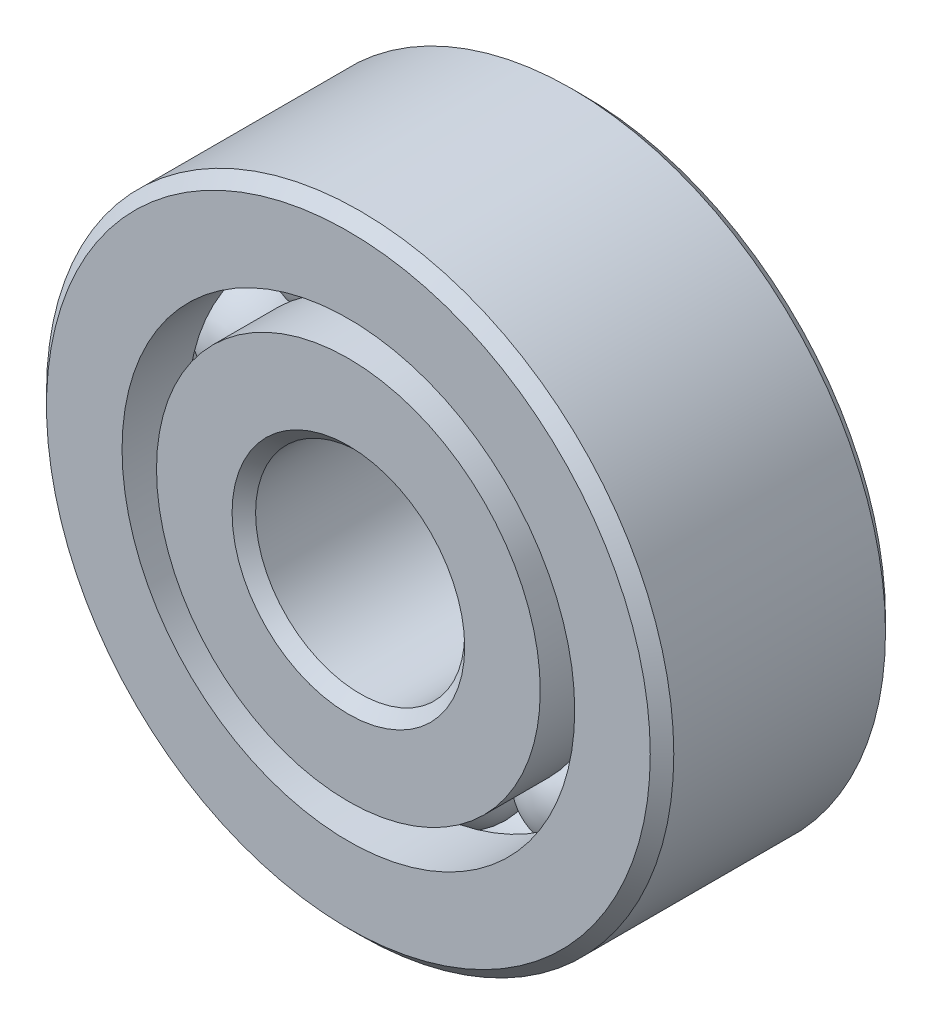
ISO-10303-21;
HEADER;
FILE_DESCRIPTION(('STEP AP214'),'2;1');
FILE_NAME('part.step','',(''),(''),'','','');
FILE_SCHEMA(('AUTOMOTIVE_DESIGN { 1 0 10303 214 1 1 1 1 }'));
ENDSEC;
DATA;
#1=APPLICATION_CONTEXT('core data for automotive mechanical design processes');
#2=APPLICATION_PROTOCOL_DEFINITION('international standard','automotive_design',2000,#1);
#3=PRODUCT_CONTEXT('',#1,'mechanical');
#4=PRODUCT('Part','Part','',(#3));
#5=PRODUCT_RELATED_PRODUCT_CATEGORY('part','',(#4));
#6=PRODUCT_DEFINITION_FORMATION('','',#4);
#7=PRODUCT_DEFINITION_CONTEXT('part definition',#1,'design');
#8=PRODUCT_DEFINITION('design','',#6,#7);
#9=PRODUCT_DEFINITION_SHAPE('','',#8);
#10=(LENGTH_UNIT() NAMED_UNIT(*) SI_UNIT(.MILLI.,.METRE.));
#11=(NAMED_UNIT(*) PLANE_ANGLE_UNIT() SI_UNIT($,.RADIAN.));
#12=(NAMED_UNIT(*) SI_UNIT($,.STERADIAN.) SOLID_ANGLE_UNIT());
#13=UNCERTAINTY_MEASURE_WITH_UNIT(LENGTH_MEASURE(1.E-05),#10,'distance_accuracy_value','');
#14=(GEOMETRIC_REPRESENTATION_CONTEXT(3) GLOBAL_UNCERTAINTY_ASSIGNED_CONTEXT((#13)) GLOBAL_UNIT_ASSIGNED_CONTEXT((#10,
#11,#12)) REPRESENTATION_CONTEXT('',''));
#15=CARTESIAN_POINT('',(0.,0.,0.));
#16=DIRECTION('',(0.,0.,1.));
#17=DIRECTION('',(1.,0.,0.));
#18=AXIS2_PLACEMENT_3D('',#15,#16,#17);
#19=CARTESIAN_POINT('',(-3.73243635205714,5.13725791428097,0.));
#20=DIRECTION('',(0.,0.,1.));
#21=DIRECTION('',(-0.587785252292462,0.809016994374955,0.));
#22=AXIS2_PLACEMENT_3D('',#19,#20,#21);
#23=SPHERICAL_SURFACE('',#22,1.67154216154795);
#24=CARTESIAN_POINT('',(-3.73243635205714,5.13725791428097,1.67154216154795));
#25=VERTEX_POINT('',#24);
#26=VERTEX_LOOP('',#25);
#27=FACE_BOUND('',#26,.T.);
#28=ADVANCED_FACE('F37',(#27),#23,.T.);
#29=CLOSED_SHELL('',(#28));
#30=MANIFOLD_SOLID_BREP('B2',#29);
#31=CARTESIAN_POINT('',(-6.0392088784742,1.96225791428099,0.));
#32=DIRECTION('',(0.,0.,1.));
#33=DIRECTION('',(-0.95105651629515,0.309016994374958,0.));
#34=AXIS2_PLACEMENT_3D('',#31,#32,#33);
#35=SPHERICAL_SURFACE('',#34,1.67154216154795);
#36=CARTESIAN_POINT('',(-6.0392088784742,1.96225791428099,1.67154216154795));
#37=VERTEX_POINT('',#36);
#38=VERTEX_LOOP('',#37);
#39=FACE_BOUND('',#38,.T.);
#40=ADVANCED_FACE('F57',(#39),#35,.T.);
#41=CLOSED_SHELL('',(#40));
#42=MANIFOLD_SOLID_BREP('B6',#41);
#43=CARTESIAN_POINT('',(-6.03920887847425,-1.96225791428086,0.));
#44=DIRECTION('',(0.,0.,1.));
#45=DIRECTION('',(-0.951056516295157,-0.309016994374938,0.));
#46=AXIS2_PLACEMENT_3D('',#43,#44,#45);
#47=SPHERICAL_SURFACE('',#46,1.67154216154795);
#48=CARTESIAN_POINT('',(-6.03920887847425,-1.96225791428086,1.67154216154795));
#49=VERTEX_POINT('',#48);
#50=VERTEX_LOOP('',#49);
#51=FACE_BOUND('',#50,.T.);
#52=ADVANCED_FACE('F77',(#51),#47,.T.);
#53=CLOSED_SHELL('',(#52));
#54=MANIFOLD_SOLID_BREP('B33',#53);
#55=CARTESIAN_POINT('',(-3.73243635205725,-5.13725791428089,0.));
#56=DIRECTION('',(0.,0.,1.));
#57=DIRECTION('',(-0.58778525229248,-0.809016994374942,0.));
#58=AXIS2_PLACEMENT_3D('',#55,#56,#57);
#59=SPHERICAL_SURFACE('',#58,1.67154216154795);
#60=CARTESIAN_POINT('',(-3.73243635205725,-5.13725791428089,1.67154216154795));
#61=VERTEX_POINT('',#60);
#62=VERTEX_LOOP('',#61);
#63=FACE_BOUND('',#62,.T.);
#64=ADVANCED_FACE('F97',(#63),#59,.T.);
#65=CLOSED_SHELL('',(#64));
#66=MANIFOLD_SOLID_BREP('B53',#65);
#67=CARTESIAN_POINT('',(0.,-6.35,0.));
#68=DIRECTION('',(0.,0.,1.));
#69=DIRECTION('',(0.,-1.,0.));
#70=AXIS2_PLACEMENT_3D('',#67,#68,#69);
#71=SPHERICAL_SURFACE('',#70,1.67154216154795);
#72=CARTESIAN_POINT('',(0.,-6.35,1.67154216154795));
#73=VERTEX_POINT('',#72);
#74=VERTEX_LOOP('',#73);
#75=FACE_BOUND('',#74,.T.);
#76=ADVANCED_FACE('F117',(#75),#71,.T.);
#77=CLOSED_SHELL('',(#76));
#78=MANIFOLD_SOLID_BREP('B73',#77);
#79=CARTESIAN_POINT('',(3.73243635205718,-5.13725791428094,0.));
#80=DIRECTION('',(0.,0.,1.));
#81=DIRECTION('',(0.587785252292469,-0.809016994374951,0.));
#82=AXIS2_PLACEMENT_3D('',#79,#80,#81);
#83=SPHERICAL_SURFACE('',#82,1.67154216154795);
#84=CARTESIAN_POINT('',(3.73243635205718,-5.13725791428094,1.67154216154795));
#85=VERTEX_POINT('',#84);
#86=VERTEX_LOOP('',#85);
#87=FACE_BOUND('',#86,.T.);
#88=ADVANCED_FACE('F137',(#87),#83,.T.);
#89=CLOSED_SHELL('',(#88));
#90=MANIFOLD_SOLID_BREP('B93',#89);
#91=CARTESIAN_POINT('',(6.03920887847422,-1.96225791428094,0.));
#92=DIRECTION('',(0.,0.,1.));
#93=DIRECTION('',(0.951056516295152,-0.309016994374952,0.));
#94=AXIS2_PLACEMENT_3D('',#91,#92,#93);
#95=SPHERICAL_SURFACE('',#94,1.67154216154795);
#96=CARTESIAN_POINT('',(6.03920887847422,-1.96225791428094,1.67154216154795));
#97=VERTEX_POINT('',#96);
#98=VERTEX_LOOP('',#97);
#99=FACE_BOUND('',#98,.T.);
#100=ADVANCED_FACE('F157',(#99),#95,.T.);
#101=CLOSED_SHELL('',(#100));
#102=MANIFOLD_SOLID_BREP('B113',#101);
#103=CARTESIAN_POINT('',(6.03920887847423,1.9622579142809,0.));
#104=DIRECTION('',(0.,0.,1.));
#105=DIRECTION('',(0.951056516295155,0.309016994374945,0.));
#106=AXIS2_PLACEMENT_3D('',#103,#104,#105);
#107=SPHERICAL_SURFACE('',#106,1.67154216154795);
#108=CARTESIAN_POINT('',(6.03920887847423,1.9622579142809,1.67154216154795));
#109=VERTEX_POINT('',#108);
#110=VERTEX_LOOP('',#109);
#111=FACE_BOUND('',#110,.T.);
#112=ADVANCED_FACE('F177',(#111),#107,.T.);
#113=CLOSED_SHELL('',(#112));
#114=MANIFOLD_SOLID_BREP('B133',#113);
#115=CARTESIAN_POINT('',(3.73243635205721,5.13725791428091,0.));
#116=DIRECTION('',(0.,0.,1.));
#117=DIRECTION('',(0.587785252292474,0.809016994374947,0.));
#118=AXIS2_PLACEMENT_3D('',#115,#116,#117);
#119=SPHERICAL_SURFACE('',#118,1.67154216154795);
#120=CARTESIAN_POINT('',(3.73243635205721,5.13725791428091,1.67154216154795));
#121=VERTEX_POINT('',#120);
#122=VERTEX_LOOP('',#121);
#123=FACE_BOUND('',#122,.T.);
#124=ADVANCED_FACE('F197',(#123),#119,.T.);
#125=CLOSED_SHELL('',(#124));
#126=MANIFOLD_SOLID_BREP('B153',#125);
#127=CARTESIAN_POINT('',(0.,6.35,0.));
#128=DIRECTION('',(0.,0.,1.));
#129=DIRECTION('',(0.,1.,0.));
#130=AXIS2_PLACEMENT_3D('',#127,#128,#129);
#131=SPHERICAL_SURFACE('',#130,1.67154216154795);
#132=CARTESIAN_POINT('',(0.,6.35,1.67154216154795));
#133=VERTEX_POINT('',#132);
#134=VERTEX_LOOP('',#133);
#135=FACE_BOUND('',#134,.T.);
#136=ADVANCED_FACE('F219',(#135),#131,.T.);
#137=CLOSED_SHELL('',(#136));
#138=MANIFOLD_SOLID_BREP('B173',#137);
#139=CARTESIAN_POINT('',(0.,5.82664835164835,3.571875));
#140=DIRECTION('',(0.,0.,-1.));
#141=DIRECTION('',(-1.,0.,0.));
#142=AXIS2_PLACEMENT_3D('',#139,#140,#141);
#143=PLANE('',#142);
#144=CARTESIAN_POINT('',(0.,0.,3.571875));
#145=DIRECTION('',(0.,0.,1.));
#146=DIRECTION('',(1.,0.,0.));
#147=AXIS2_PLACEMENT_3D('',#144,#145,#146);
#148=CIRCLE('',#147,3.5321875);
#149=CARTESIAN_POINT('',(3.5321875,0.,3.571875));
#150=VERTEX_POINT('',#149);
#151=EDGE_CURVE('E266',#150,#150,#148,.T.);
#152=ORIENTED_EDGE('',*,*,#151,.F.);
#153=EDGE_LOOP('',(#152));
#154=FACE_BOUND('',#153,.T.);
#155=CARTESIAN_POINT('',(0.,0.,3.571875));
#156=DIRECTION('',(0.,0.,1.));
#157=DIRECTION('',(1.,0.,0.));
#158=AXIS2_PLACEMENT_3D('',#155,#156,#157);
#159=CIRCLE('',#158,5.82664835164835);
#160=CARTESIAN_POINT('',(5.82664835164835,0.,3.571875));
#161=VERTEX_POINT('',#160);
#162=EDGE_CURVE('E218',#161,#161,#159,.T.);
#163=ORIENTED_EDGE('',*,*,#162,.T.);
#164=EDGE_LOOP('',(#163));
#165=FACE_BOUND('',#164,.T.);
#166=ADVANCED_FACE('F238',(#154,#165),#143,.F.);
#167=CARTESIAN_POINT('',(0.,0.,3.571875));
#168=DIRECTION('',(0.,0.,1.));
#169=DIRECTION('',(1.,0.,0.));
#170=AXIS2_PLACEMENT_3D('',#167,#168,#169);
#171=CYLINDRICAL_SURFACE('',#170,5.82664835164835);
#172=ORIENTED_EDGE('',*,*,#162,.F.);
#173=EDGE_LOOP('',(#172));
#174=FACE_BOUND('',#173,.T.);
#175=CARTESIAN_POINT('',(0.,0.,1.5875));
#176=DIRECTION('',(0.,0.,1.));
#177=DIRECTION('',(1.,0.,0.));
#178=AXIS2_PLACEMENT_3D('',#175,#176,#177);
#179=CIRCLE('',#178,5.82664835164835);
#180=CARTESIAN_POINT('',(5.82664835164835,0.,1.5875));
#181=VERTEX_POINT('',#180);
#182=EDGE_CURVE('E244',#181,#181,#179,.T.);
#183=ORIENTED_EDGE('',*,*,#182,.T.);
#184=EDGE_LOOP('',(#183));
#185=FACE_BOUND('',#184,.T.);
#186=ADVANCED_FACE('F273',(#174,#185),#171,.T.);
#187=CARTESIAN_POINT('',(0.,0.,0.));
#188=DIRECTION('',(0.,0.,1.));
#189=DIRECTION('',(1.,0.,0.));
#190=AXIS2_PLACEMENT_3D('',#187,#188,#189);
#191=TOROIDAL_SURFACE('',#190,6.34999999999999,1.67154216154794);
#192=ORIENTED_EDGE('',*,*,#182,.F.);
#193=EDGE_LOOP('',(#192));
#194=FACE_BOUND('',#193,.T.);
#195=CARTESIAN_POINT('',(0.,0.,-1.5875));
#196=DIRECTION('',(0.,0.,1.));
#197=DIRECTION('',(1.,0.,0.));
#198=AXIS2_PLACEMENT_3D('',#195,#196,#197);
#199=CIRCLE('',#198,5.82664835164835);
#200=CARTESIAN_POINT('',(5.82664835164835,0.,-1.5875));
#201=VERTEX_POINT('',#200);
#202=EDGE_CURVE('E248',#201,#201,#199,.T.);
#203=ORIENTED_EDGE('',*,*,#202,.T.);
#204=EDGE_LOOP('',(#203));
#205=FACE_BOUND('',#204,.T.);
#206=ADVANCED_FACE('F277',(#194,#205),#191,.F.);
#207=CARTESIAN_POINT('',(0.,0.,3.571875));
#208=DIRECTION('',(0.,0.,1.));
#209=DIRECTION('',(1.,0.,0.));
#210=AXIS2_PLACEMENT_3D('',#207,#208,#209);
#211=CYLINDRICAL_SURFACE('',#210,5.82664835164835);
#212=ORIENTED_EDGE('',*,*,#202,.F.);
#213=EDGE_LOOP('',(#212));
#214=FACE_BOUND('',#213,.T.);
#215=CARTESIAN_POINT('',(0.,0.,-3.571875));
#216=DIRECTION('',(0.,0.,1.));
#217=DIRECTION('',(1.,0.,0.));
#218=AXIS2_PLACEMENT_3D('',#215,#216,#217);
#219=CIRCLE('',#218,5.82664835164835);
#220=CARTESIAN_POINT('',(5.82664835164835,0.,-3.571875));
#221=VERTEX_POINT('',#220);
#222=EDGE_CURVE('E252',#221,#221,#219,.T.);
#223=ORIENTED_EDGE('',*,*,#222,.T.);
#224=EDGE_LOOP('',(#223));
#225=FACE_BOUND('',#224,.T.);
#226=ADVANCED_FACE('F282',(#214,#225),#211,.T.);
#227=CARTESIAN_POINT('',(0.,3.5321875,-3.571875));
#228=DIRECTION('',(0.,0.,1.));
#229=DIRECTION('',(1.,0.,0.));
#230=AXIS2_PLACEMENT_3D('',#227,#228,#229);
#231=PLANE('',#230);
#232=ORIENTED_EDGE('',*,*,#222,.F.);
#233=EDGE_LOOP('',(#232));
#234=FACE_BOUND('',#233,.T.);
#235=CARTESIAN_POINT('',(0.,0.,-3.57187500000001));
#236=DIRECTION('',(0.,0.,1.));
#237=DIRECTION('',(1.,0.,0.));
#238=AXIS2_PLACEMENT_3D('',#235,#236,#237);
#239=CIRCLE('',#238,3.5321875);
#240=CARTESIAN_POINT('',(3.5321875,0.,-3.57187500000001));
#241=VERTEX_POINT('',#240);
#242=EDGE_CURVE('E257',#241,#241,#239,.T.);
#243=ORIENTED_EDGE('',*,*,#242,.T.);
#244=EDGE_LOOP('',(#243));
#245=FACE_BOUND('',#244,.T.);
#246=ADVANCED_FACE('F288',(#234,#245),#231,.F.);
#247=CARTESIAN_POINT('',(0.,0.,-3.2146875));
#248=DIRECTION('',(0.,0.,-1.));
#249=DIRECTION('',(-1.,0.,0.));
#250=AXIS2_PLACEMENT_3D('',#247,#248,#249);
#251=CONICAL_SURFACE('',#250,3.175,0.785398163397445);
#252=ORIENTED_EDGE('',*,*,#242,.F.);
#253=EDGE_LOOP('',(#252));
#254=FACE_BOUND('',#253,.T.);
#255=CARTESIAN_POINT('',(0.,0.,-3.2146875));
#256=DIRECTION('',(0.,0.,1.));
#257=DIRECTION('',(1.,0.,0.));
#258=AXIS2_PLACEMENT_3D('',#255,#256,#257);
#259=CIRCLE('',#258,3.175);
#260=CARTESIAN_POINT('',(3.175,0.,-3.2146875));
#261=VERTEX_POINT('',#260);
#262=EDGE_CURVE('E260',#261,#261,#259,.T.);
#263=ORIENTED_EDGE('',*,*,#262,.T.);
#264=EDGE_LOOP('',(#263));
#265=FACE_BOUND('',#264,.T.);
#266=ADVANCED_FACE('F292',(#254,#265),#251,.F.);
#267=CARTESIAN_POINT('',(0.,0.,3.571875));
#268=DIRECTION('',(0.,0.,1.));
#269=DIRECTION('',(1.,0.,0.));
#270=AXIS2_PLACEMENT_3D('',#267,#268,#269);
#271=CYLINDRICAL_SURFACE('',#270,3.175);
#272=ORIENTED_EDGE('',*,*,#262,.F.);
#273=EDGE_LOOP('',(#272));
#274=FACE_BOUND('',#273,.T.);
#275=CARTESIAN_POINT('',(0.,0.,3.21468750000001));
#276=DIRECTION('',(0.,0.,1.));
#277=DIRECTION('',(1.,0.,0.));
#278=AXIS2_PLACEMENT_3D('',#275,#276,#277);
#279=CIRCLE('',#278,3.175);
#280=CARTESIAN_POINT('',(3.175,0.,3.21468750000001));
#281=VERTEX_POINT('',#280);
#282=EDGE_CURVE('E263',#281,#281,#279,.T.);
#283=ORIENTED_EDGE('',*,*,#282,.T.);
#284=EDGE_LOOP('',(#283));
#285=FACE_BOUND('',#284,.T.);
#286=ADVANCED_FACE('F296',(#274,#285),#271,.F.);
#287=CARTESIAN_POINT('',(0.,0.,3.571875));
#288=DIRECTION('',(0.,0.,1.));
#289=DIRECTION('',(1.,0.,0.));
#290=AXIS2_PLACEMENT_3D('',#287,#288,#289);
#291=CONICAL_SURFACE('',#290,3.5321875,0.785398163397453);
#292=ORIENTED_EDGE('',*,*,#282,.F.);
#293=EDGE_LOOP('',(#292));
#294=FACE_BOUND('',#293,.T.);
#295=ORIENTED_EDGE('',*,*,#151,.T.);
#296=EDGE_LOOP('',(#295));
#297=FACE_BOUND('',#296,.T.);
#298=ADVANCED_FACE('F270',(#294,#297),#291,.F.);
#299=CLOSED_SHELL('',(#166,#186,#206,#226,#246,#266,#286,#298));
#300=MANIFOLD_SOLID_BREP('B193',#299);
#301=CARTESIAN_POINT('',(0.,0.,3.2146875));
#302=DIRECTION('',(0.,0.,-1.));
#303=DIRECTION('',(-1.,0.,0.));
#304=AXIS2_PLACEMENT_3D('',#301,#302,#303);
#305=CONICAL_SURFACE('',#304,9.525,0.785398163397449);
#306=CARTESIAN_POINT('',(0.,0.,3.571875));
#307=DIRECTION('',(0.,0.,1.));
#308=DIRECTION('',(1.,0.,0.));
#309=AXIS2_PLACEMENT_3D('',#306,#307,#308);
#310=CIRCLE('',#309,9.1678125);
#311=CARTESIAN_POINT('',(9.1678125,0.,3.571875));
#312=VERTEX_POINT('',#311);
#313=EDGE_CURVE('E387',#312,#312,#310,.T.);
#314=ORIENTED_EDGE('',*,*,#313,.F.);
#315=EDGE_LOOP('',(#314));
#316=FACE_BOUND('',#315,.T.);
#317=CARTESIAN_POINT('',(0.,0.,3.2146875));
#318=DIRECTION('',(0.,0.,1.));
#319=DIRECTION('',(1.,0.,0.));
#320=AXIS2_PLACEMENT_3D('',#317,#318,#319);
#321=CIRCLE('',#320,9.525);
#322=CARTESIAN_POINT('',(9.525,0.,3.2146875));
#323=VERTEX_POINT('',#322);
#324=EDGE_CURVE('E237',#323,#323,#321,.T.);
#325=ORIENTED_EDGE('',*,*,#324,.T.);
#326=EDGE_LOOP('',(#325));
#327=FACE_BOUND('',#326,.T.);
#328=ADVANCED_FACE('F359',(#316,#327),#305,.T.);
#329=CARTESIAN_POINT('',(0.,0.,3.571875));
#330=DIRECTION('',(0.,0.,1.));
#331=DIRECTION('',(1.,0.,0.));
#332=AXIS2_PLACEMENT_3D('',#329,#330,#331);
#333=CYLINDRICAL_SURFACE('',#332,9.525);
#334=ORIENTED_EDGE('',*,*,#324,.F.);
#335=EDGE_LOOP('',(#334));
#336=FACE_BOUND('',#335,.T.);
#337=CARTESIAN_POINT('',(0.,0.,-3.2146875));
#338=DIRECTION('',(0.,0.,1.));
#339=DIRECTION('',(1.,0.,0.));
#340=AXIS2_PLACEMENT_3D('',#337,#338,#339);
#341=CIRCLE('',#340,9.525);
#342=CARTESIAN_POINT('',(9.525,0.,-3.2146875));
#343=VERTEX_POINT('',#342);
#344=EDGE_CURVE('E365',#343,#343,#341,.T.);
#345=ORIENTED_EDGE('',*,*,#344,.T.);
#346=EDGE_LOOP('',(#345));
#347=FACE_BOUND('',#346,.T.);
#348=ADVANCED_FACE('F394',(#336,#347),#333,.T.);
#349=CARTESIAN_POINT('',(0.,0.,-3.57187500000001));
#350=DIRECTION('',(0.,0.,1.));
#351=DIRECTION('',(1.,0.,0.));
#352=AXIS2_PLACEMENT_3D('',#349,#350,#351);
#353=CONICAL_SURFACE('',#352,9.1678125,0.785398163397445);
#354=ORIENTED_EDGE('',*,*,#344,.F.);
#355=EDGE_LOOP('',(#354));
#356=FACE_BOUND('',#355,.T.);
#357=CARTESIAN_POINT('',(0.,0.,-3.57187500000001));
#358=DIRECTION('',(0.,0.,1.));
#359=DIRECTION('',(1.,0.,0.));
#360=AXIS2_PLACEMENT_3D('',#357,#358,#359);
#361=CIRCLE('',#360,9.1678125);
#362=CARTESIAN_POINT('',(9.1678125,0.,-3.57187500000001));
#363=VERTEX_POINT('',#362);
#364=EDGE_CURVE('E369',#363,#363,#361,.T.);
#365=ORIENTED_EDGE('',*,*,#364,.T.);
#366=EDGE_LOOP('',(#365));
#367=FACE_BOUND('',#366,.T.);
#368=ADVANCED_FACE('F398',(#356,#367),#353,.T.);
#369=CARTESIAN_POINT('',(0.,9.1678125,-3.571875));
#370=DIRECTION('',(0.,0.,1.));
#371=DIRECTION('',(1.,0.,0.));
#372=AXIS2_PLACEMENT_3D('',#369,#370,#371);
#373=PLANE('',#372);
#374=ORIENTED_EDGE('',*,*,#364,.F.);
#375=EDGE_LOOP('',(#374));
#376=FACE_BOUND('',#375,.T.);
#377=CARTESIAN_POINT('',(0.,0.,-3.571875));
#378=DIRECTION('',(0.,0.,1.));
#379=DIRECTION('',(1.,0.,0.));
#380=AXIS2_PLACEMENT_3D('',#377,#378,#379);
#381=CIRCLE('',#380,6.87335164835165);
#382=CARTESIAN_POINT('',(6.87335164835165,0.,-3.571875));
#383=VERTEX_POINT('',#382);
#384=EDGE_CURVE('E373',#383,#383,#381,.T.);
#385=ORIENTED_EDGE('',*,*,#384,.T.);
#386=EDGE_LOOP('',(#385));
#387=FACE_BOUND('',#386,.T.);
#388=ADVANCED_FACE('F403',(#376,#387),#373,.F.);
#389=CARTESIAN_POINT('',(0.,0.,3.571875));
#390=DIRECTION('',(0.,0.,1.));
#391=DIRECTION('',(1.,0.,0.));
#392=AXIS2_PLACEMENT_3D('',#389,#390,#391);
#393=CYLINDRICAL_SURFACE('',#392,6.87335164835165);
#394=ORIENTED_EDGE('',*,*,#384,.F.);
#395=EDGE_LOOP('',(#394));
#396=FACE_BOUND('',#395,.T.);
#397=CARTESIAN_POINT('',(0.,0.,-1.5875));
#398=DIRECTION('',(0.,0.,1.));
#399=DIRECTION('',(1.,0.,0.));
#400=AXIS2_PLACEMENT_3D('',#397,#398,#399);
#401=CIRCLE('',#400,6.87335164835165);
#402=CARTESIAN_POINT('',(6.87335164835165,0.,-1.5875));
#403=VERTEX_POINT('',#402);
#404=EDGE_CURVE('E378',#403,#403,#401,.T.);
#405=ORIENTED_EDGE('',*,*,#404,.T.);
#406=EDGE_LOOP('',(#405));
#407=FACE_BOUND('',#406,.T.);
#408=ADVANCED_FACE('F409',(#396,#407),#393,.F.);
#409=CARTESIAN_POINT('',(0.,0.,0.));
#410=DIRECTION('',(0.,0.,1.));
#411=DIRECTION('',(1.,0.,0.));
#412=AXIS2_PLACEMENT_3D('',#409,#410,#411);
#413=TOROIDAL_SURFACE('',#412,6.35,1.67154216154795);
#414=ORIENTED_EDGE('',*,*,#404,.F.);
#415=EDGE_LOOP('',(#414));
#416=FACE_BOUND('',#415,.T.);
#417=CARTESIAN_POINT('',(0.,0.,1.5875));
#418=DIRECTION('',(0.,0.,1.));
#419=DIRECTION('',(1.,0.,0.));
#420=AXIS2_PLACEMENT_3D('',#417,#418,#419);
#421=CIRCLE('',#420,6.87335164835165);
#422=CARTESIAN_POINT('',(6.87335164835165,0.,1.5875));
#423=VERTEX_POINT('',#422);
#424=EDGE_CURVE('E381',#423,#423,#421,.T.);
#425=ORIENTED_EDGE('',*,*,#424,.T.);
#426=EDGE_LOOP('',(#425));
#427=FACE_BOUND('',#426,.T.);
#428=ADVANCED_FACE('F413',(#416,#427),#413,.F.);
#429=CARTESIAN_POINT('',(0.,0.,3.571875));
#430=DIRECTION('',(0.,0.,1.));
#431=DIRECTION('',(1.,0.,0.));
#432=AXIS2_PLACEMENT_3D('',#429,#430,#431);
#433=CYLINDRICAL_SURFACE('',#432,6.87335164835165);
#434=ORIENTED_EDGE('',*,*,#424,.F.);
#435=EDGE_LOOP('',(#434));
#436=FACE_BOUND('',#435,.T.);
#437=CARTESIAN_POINT('',(0.,0.,3.571875));
#438=DIRECTION('',(0.,0.,1.));
#439=DIRECTION('',(1.,0.,0.));
#440=AXIS2_PLACEMENT_3D('',#437,#438,#439);
#441=CIRCLE('',#440,6.87335164835165);
#442=CARTESIAN_POINT('',(6.87335164835165,0.,3.571875));
#443=VERTEX_POINT('',#442);
#444=EDGE_CURVE('E384',#443,#443,#441,.T.);
#445=ORIENTED_EDGE('',*,*,#444,.T.);
#446=EDGE_LOOP('',(#445));
#447=FACE_BOUND('',#446,.T.);
#448=ADVANCED_FACE('F417',(#436,#447),#433,.F.);
#449=CARTESIAN_POINT('',(0.,9.1678125,3.571875));
#450=DIRECTION('',(0.,0.,-1.));
#451=DIRECTION('',(-1.,0.,0.));
#452=AXIS2_PLACEMENT_3D('',#449,#450,#451);
#453=PLANE('',#452);
#454=ORIENTED_EDGE('',*,*,#444,.F.);
#455=EDGE_LOOP('',(#454));
#456=FACE_BOUND('',#455,.T.);
#457=ORIENTED_EDGE('',*,*,#313,.T.);
#458=EDGE_LOOP('',(#457));
#459=FACE_BOUND('',#458,.T.);
#460=ADVANCED_FACE('F391',(#456,#459),#453,.F.);
#461=CLOSED_SHELL('',(#328,#348,#368,#388,#408,#428,#448,#460));
#462=MANIFOLD_SOLID_BREP('B213',#461);
#463=ADVANCED_BREP_SHAPE_REPRESENTATION('',(#18,#30,#42,#54,#66,#78,#90,#102,#114,#126,#138,
#300,#462),#14);
#464=SHAPE_DEFINITION_REPRESENTATION(#9,#463);
ENDSEC;
END-ISO-10303-21;
